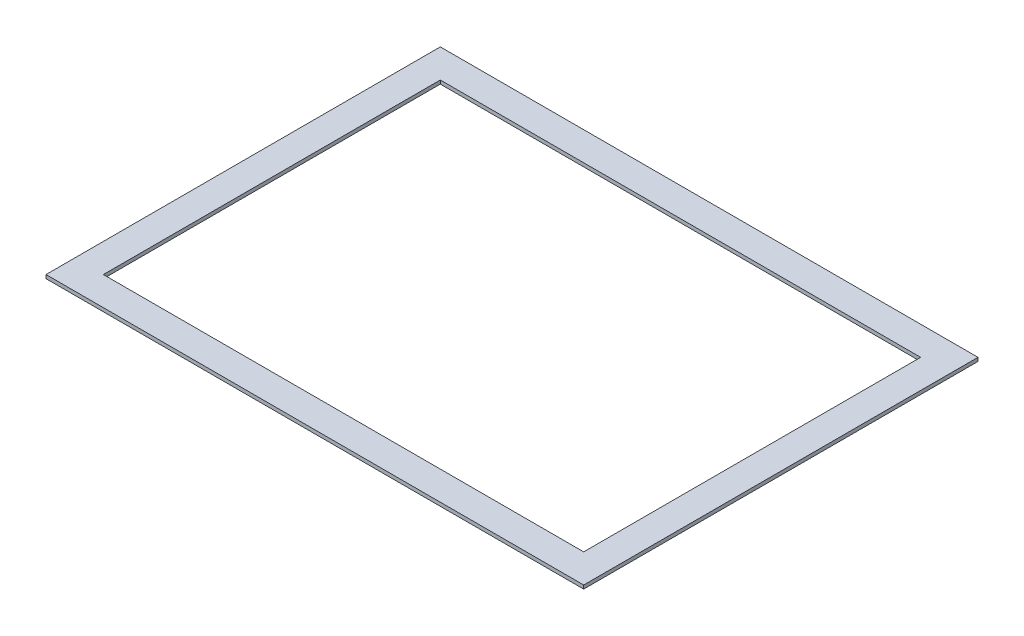
ISO-10303-21;
HEADER;
FILE_DESCRIPTION(('STEP AP214'),'2;1');
FILE_NAME('part.step','',(''),(''),'','','');
FILE_SCHEMA(('AUTOMOTIVE_DESIGN { 1 0 10303 214 1 1 1 1 }'));
ENDSEC;
DATA;
#1=APPLICATION_CONTEXT('core data for automotive mechanical design processes');
#2=APPLICATION_PROTOCOL_DEFINITION('international standard','automotive_design',2000,#1);
#3=PRODUCT_CONTEXT('',#1,'mechanical');
#4=PRODUCT('Part','Part','',(#3));
#5=PRODUCT_RELATED_PRODUCT_CATEGORY('part','',(#4));
#6=PRODUCT_DEFINITION_FORMATION('','',#4);
#7=PRODUCT_DEFINITION_CONTEXT('part definition',#1,'design');
#8=PRODUCT_DEFINITION('design','',#6,#7);
#9=PRODUCT_DEFINITION_SHAPE('','',#8);
#10=(LENGTH_UNIT() NAMED_UNIT(*) SI_UNIT(.MILLI.,.METRE.));
#11=(NAMED_UNIT(*) PLANE_ANGLE_UNIT() SI_UNIT($,.RADIAN.));
#12=(NAMED_UNIT(*) SI_UNIT($,.STERADIAN.) SOLID_ANGLE_UNIT());
#13=UNCERTAINTY_MEASURE_WITH_UNIT(LENGTH_MEASURE(1.E-05),#10,'distance_accuracy_value','');
#14=(GEOMETRIC_REPRESENTATION_CONTEXT(3) GLOBAL_UNCERTAINTY_ASSIGNED_CONTEXT((#13)) GLOBAL_UNIT_ASSIGNED_CONTEXT((#10,
#11,#12)) REPRESENTATION_CONTEXT('',''));
#15=CARTESIAN_POINT('',(0.,0.,0.));
#16=DIRECTION('',(0.,0.,1.));
#17=DIRECTION('',(1.,0.,0.));
#18=AXIS2_PLACEMENT_3D('',#15,#16,#17);
#19=CARTESIAN_POINT('',(0.,3.175,0.));
#20=DIRECTION('',(0.,-1.,0.));
#21=DIRECTION('',(0.,0.,-1.));
#22=AXIS2_PLACEMENT_3D('',#19,#20,#21);
#23=PLANE('',#22);
#24=DIRECTION('',(0.,0.,-1.));
#25=VECTOR('',#24,1.);
#26=CARTESIAN_POINT('',(238.125,3.175,174.625));
#27=LINE('',#26,#25);
#28=CARTESIAN_POINT('',(238.125,3.175,174.625));
#29=VERTEX_POINT('',#28);
#30=CARTESIAN_POINT('',(238.125,3.175,-174.625));
#31=VERTEX_POINT('',#30);
#32=EDGE_CURVE('E159',#29,#31,#27,.T.);
#33=ORIENTED_EDGE('',*,*,#32,.T.);
#34=DIRECTION('',(-1.,0.,0.));
#35=VECTOR('',#34,1.);
#36=CARTESIAN_POINT('',(-238.125,3.175,-174.625));
#37=LINE('',#36,#35);
#38=CARTESIAN_POINT('',(-238.125,3.175,-174.625));
#39=VERTEX_POINT('',#38);
#40=EDGE_CURVE('E163',#31,#39,#37,.T.);
#41=ORIENTED_EDGE('',*,*,#40,.T.);
#42=DIRECTION('',(0.,0.,1.));
#43=VECTOR('',#42,1.);
#44=CARTESIAN_POINT('',(-238.125,3.175,174.625));
#45=LINE('',#44,#43);
#46=CARTESIAN_POINT('',(-238.125,3.175,174.625));
#47=VERTEX_POINT('',#46);
#48=EDGE_CURVE('E167',#39,#47,#45,.T.);
#49=ORIENTED_EDGE('',*,*,#48,.T.);
#50=DIRECTION('',(1.,0.,0.));
#51=VECTOR('',#50,1.);
#52=CARTESIAN_POINT('',(-238.125,3.175,174.625));
#53=LINE('',#52,#51);
#54=EDGE_CURVE('E170',#47,#29,#53,.T.);
#55=ORIENTED_EDGE('',*,*,#54,.T.);
#56=EDGE_LOOP('',(#33,#41,#49,#55));
#57=FACE_BOUND('',#56,.T.);
#58=DIRECTION('',(0.,0.,1.));
#59=VECTOR('',#58,1.);
#60=CARTESIAN_POINT('',(-212.725,3.175,149.225));
#61=LINE('',#60,#59);
#62=CARTESIAN_POINT('',(-212.725,3.175,-149.225));
#63=VERTEX_POINT('',#62);
#64=CARTESIAN_POINT('',(-212.725,3.175,149.225));
#65=VERTEX_POINT('',#64);
#66=EDGE_CURVE('E111',#63,#65,#61,.T.);
#67=ORIENTED_EDGE('',*,*,#66,.F.);
#68=DIRECTION('',(-1.,0.,0.));
#69=VECTOR('',#68,1.);
#70=CARTESIAN_POINT('',(-212.725,3.175,-149.225));
#71=LINE('',#70,#69);
#72=CARTESIAN_POINT('',(212.725,3.175,-149.225));
#73=VERTEX_POINT('',#72);
#74=EDGE_CURVE('E137',#73,#63,#71,.T.);
#75=ORIENTED_EDGE('',*,*,#74,.F.);
#76=DIRECTION('',(0.,0.,-1.));
#77=VECTOR('',#76,1.);
#78=CARTESIAN_POINT('',(212.725,3.175,149.225));
#79=LINE('',#78,#77);
#80=CARTESIAN_POINT('',(212.725,3.175,149.225));
#81=VERTEX_POINT('',#80);
#82=EDGE_CURVE('E133',#81,#73,#79,.T.);
#83=ORIENTED_EDGE('',*,*,#82,.F.);
#84=DIRECTION('',(1.,0.,0.));
#85=VECTOR('',#84,1.);
#86=CARTESIAN_POINT('',(-212.725,3.175,149.225));
#87=LINE('',#86,#85);
#88=EDGE_CURVE('E120',#65,#81,#87,.T.);
#89=ORIENTED_EDGE('',*,*,#88,.F.);
#90=EDGE_LOOP('',(#67,#75,#83,#89));
#91=FACE_BOUND('',#90,.T.);
#92=ADVANCED_FACE('F45',(#57,#91),#23,.F.);
#93=CARTESIAN_POINT('',(0.,0.,0.));
#94=DIRECTION('',(0.,-1.,0.));
#95=DIRECTION('',(0.,0.,-1.));
#96=AXIS2_PLACEMENT_3D('',#93,#94,#95);
#97=PLANE('',#96);
#98=DIRECTION('',(0.,0.,-1.));
#99=VECTOR('',#98,1.);
#100=CARTESIAN_POINT('',(238.125,0.,174.625));
#101=LINE('',#100,#99);
#102=CARTESIAN_POINT('',(238.125,0.,174.625));
#103=VERTEX_POINT('',#102);
#104=CARTESIAN_POINT('',(238.125,0.,-174.625));
#105=VERTEX_POINT('',#104);
#106=EDGE_CURVE('E129',#103,#105,#101,.T.);
#107=ORIENTED_EDGE('',*,*,#106,.F.);
#108=DIRECTION('',(1.,0.,0.));
#109=VECTOR('',#108,1.);
#110=CARTESIAN_POINT('',(-238.125,0.,174.625));
#111=LINE('',#110,#109);
#112=CARTESIAN_POINT('',(-238.125,0.,174.625));
#113=VERTEX_POINT('',#112);
#114=EDGE_CURVE('E164',#113,#103,#111,.T.);
#115=ORIENTED_EDGE('',*,*,#114,.F.);
#116=DIRECTION('',(0.,0.,1.));
#117=VECTOR('',#116,1.);
#118=CARTESIAN_POINT('',(-238.125,0.,174.625));
#119=LINE('',#118,#117);
#120=CARTESIAN_POINT('',(-238.125,0.,-174.625));
#121=VERTEX_POINT('',#120);
#122=EDGE_CURVE('E180',#121,#113,#119,.T.);
#123=ORIENTED_EDGE('',*,*,#122,.F.);
#124=DIRECTION('',(-1.,0.,0.));
#125=VECTOR('',#124,1.);
#126=CARTESIAN_POINT('',(-238.125,0.,-174.625));
#127=LINE('',#126,#125);
#128=EDGE_CURVE('E177',#105,#121,#127,.T.);
#129=ORIENTED_EDGE('',*,*,#128,.F.);
#130=EDGE_LOOP('',(#107,#115,#123,#129));
#131=FACE_BOUND('',#130,.T.);
#132=DIRECTION('',(-1.,0.,0.));
#133=VECTOR('',#132,1.);
#134=CARTESIAN_POINT('',(-212.725,0.,-149.225));
#135=LINE('',#134,#133);
#136=CARTESIAN_POINT('',(212.725,0.,-149.225));
#137=VERTEX_POINT('',#136);
#138=CARTESIAN_POINT('',(-212.725,0.,-149.225));
#139=VERTEX_POINT('',#138);
#140=EDGE_CURVE('E121',#137,#139,#135,.T.);
#141=ORIENTED_EDGE('',*,*,#140,.T.);
#142=DIRECTION('',(0.,0.,1.));
#143=VECTOR('',#142,1.);
#144=CARTESIAN_POINT('',(-212.725,0.,149.225));
#145=LINE('',#144,#143);
#146=CARTESIAN_POINT('',(-212.725,0.,149.225));
#147=VERTEX_POINT('',#146);
#148=EDGE_CURVE('E69',#139,#147,#145,.T.);
#149=ORIENTED_EDGE('',*,*,#148,.T.);
#150=DIRECTION('',(1.,0.,0.));
#151=VECTOR('',#150,1.);
#152=CARTESIAN_POINT('',(-212.725,0.,149.225));
#153=LINE('',#152,#151);
#154=CARTESIAN_POINT('',(212.725,0.,149.225));
#155=VERTEX_POINT('',#154);
#156=EDGE_CURVE('E127',#147,#155,#153,.T.);
#157=ORIENTED_EDGE('',*,*,#156,.T.);
#158=DIRECTION('',(0.,0.,-1.));
#159=VECTOR('',#158,1.);
#160=CARTESIAN_POINT('',(212.725,0.,149.225));
#161=LINE('',#160,#159);
#162=EDGE_CURVE('E146',#155,#137,#161,.T.);
#163=ORIENTED_EDGE('',*,*,#162,.T.);
#164=EDGE_LOOP('',(#141,#149,#157,#163));
#165=FACE_BOUND('',#164,.T.);
#166=ADVANCED_FACE('F203',(#131,#165),#97,.T.);
#167=CARTESIAN_POINT('',(238.125,3.175,174.625));
#168=DIRECTION('',(-1.,0.,0.));
#169=DIRECTION('',(0.,0.,1.));
#170=AXIS2_PLACEMENT_3D('',#167,#168,#169);
#171=PLANE('',#170);
#172=ORIENTED_EDGE('',*,*,#106,.T.);
#173=DIRECTION('',(0.,-1.,0.));
#174=VECTOR('',#173,1.);
#175=CARTESIAN_POINT('',(238.125,3.175,-174.625));
#176=LINE('',#175,#174);
#177=EDGE_CURVE('E11',#31,#105,#176,.T.);
#178=ORIENTED_EDGE('',*,*,#177,.F.);
#179=ORIENTED_EDGE('',*,*,#32,.F.);
#180=DIRECTION('',(0.,-1.,0.));
#181=VECTOR('',#180,1.);
#182=CARTESIAN_POINT('',(238.125,3.175,174.625));
#183=LINE('',#182,#181);
#184=EDGE_CURVE('E173',#29,#103,#183,.T.);
#185=ORIENTED_EDGE('',*,*,#184,.T.);
#186=EDGE_LOOP('',(#172,#178,#179,#185));
#187=FACE_BOUND('',#186,.T.);
#188=ADVANCED_FACE('F47',(#187),#171,.F.);
#189=CARTESIAN_POINT('',(-238.125,3.175,-174.625));
#190=DIRECTION('',(0.,0.,1.));
#191=DIRECTION('',(1.,0.,0.));
#192=AXIS2_PLACEMENT_3D('',#189,#190,#191);
#193=PLANE('',#192);
#194=ORIENTED_EDGE('',*,*,#128,.T.);
#195=DIRECTION('',(0.,-1.,0.));
#196=VECTOR('',#195,1.);
#197=CARTESIAN_POINT('',(-238.125,3.175,-174.625));
#198=LINE('',#197,#196);
#199=EDGE_CURVE('E54',#39,#121,#198,.T.);
#200=ORIENTED_EDGE('',*,*,#199,.F.);
#201=ORIENTED_EDGE('',*,*,#40,.F.);
#202=ORIENTED_EDGE('',*,*,#177,.T.);
#203=EDGE_LOOP('',(#194,#200,#201,#202));
#204=FACE_BOUND('',#203,.T.);
#205=ADVANCED_FACE('F213',(#204),#193,.F.);
#206=CARTESIAN_POINT('',(-238.125,3.175,174.625));
#207=DIRECTION('',(1.,0.,0.));
#208=DIRECTION('',(0.,0.,-1.));
#209=AXIS2_PLACEMENT_3D('',#206,#207,#208);
#210=PLANE('',#209);
#211=ORIENTED_EDGE('',*,*,#122,.T.);
#212=DIRECTION('',(0.,-1.,0.));
#213=VECTOR('',#212,1.);
#214=CARTESIAN_POINT('',(-238.125,3.175,174.625));
#215=LINE('',#214,#213);
#216=EDGE_CURVE('E188',#47,#113,#215,.T.);
#217=ORIENTED_EDGE('',*,*,#216,.F.);
#218=ORIENTED_EDGE('',*,*,#48,.F.);
#219=ORIENTED_EDGE('',*,*,#199,.T.);
#220=EDGE_LOOP('',(#211,#217,#218,#219));
#221=FACE_BOUND('',#220,.T.);
#222=ADVANCED_FACE('F197',(#221),#210,.F.);
#223=CARTESIAN_POINT('',(-238.125,3.175,174.625));
#224=DIRECTION('',(0.,0.,-1.));
#225=DIRECTION('',(-1.,0.,0.));
#226=AXIS2_PLACEMENT_3D('',#223,#224,#225);
#227=PLANE('',#226);
#228=ORIENTED_EDGE('',*,*,#114,.T.);
#229=ORIENTED_EDGE('',*,*,#184,.F.);
#230=ORIENTED_EDGE('',*,*,#54,.F.);
#231=ORIENTED_EDGE('',*,*,#216,.T.);
#232=EDGE_LOOP('',(#228,#229,#230,#231));
#233=FACE_BOUND('',#232,.T.);
#234=ADVANCED_FACE('F207',(#233),#227,.F.);
#235=CARTESIAN_POINT('',(-212.725,3.175,149.225));
#236=DIRECTION('',(1.,0.,0.));
#237=DIRECTION('',(0.,0.,-1.));
#238=AXIS2_PLACEMENT_3D('',#235,#236,#237);
#239=PLANE('',#238);
#240=ORIENTED_EDGE('',*,*,#148,.F.);
#241=DIRECTION('',(0.,-1.,0.));
#242=VECTOR('',#241,1.);
#243=CARTESIAN_POINT('',(-212.725,3.175,-149.225));
#244=LINE('',#243,#242);
#245=EDGE_CURVE('E115',#63,#139,#244,.T.);
#246=ORIENTED_EDGE('',*,*,#245,.F.);
#247=ORIENTED_EDGE('',*,*,#66,.T.);
#248=DIRECTION('',(0.,-1.,0.));
#249=VECTOR('',#248,1.);
#250=CARTESIAN_POINT('',(-212.725,3.175,149.225));
#251=LINE('',#250,#249);
#252=EDGE_CURVE('E114',#65,#147,#251,.T.);
#253=ORIENTED_EDGE('',*,*,#252,.T.);
#254=EDGE_LOOP('',(#240,#246,#247,#253));
#255=FACE_BOUND('',#254,.T.);
#256=ADVANCED_FACE('F113',(#255),#239,.T.);
#257=CARTESIAN_POINT('',(-212.725,3.175,149.225));
#258=DIRECTION('',(0.,0.,-1.));
#259=DIRECTION('',(-1.,0.,0.));
#260=AXIS2_PLACEMENT_3D('',#257,#258,#259);
#261=PLANE('',#260);
#262=ORIENTED_EDGE('',*,*,#156,.F.);
#263=ORIENTED_EDGE('',*,*,#252,.F.);
#264=ORIENTED_EDGE('',*,*,#88,.T.);
#265=DIRECTION('',(0.,-1.,0.));
#266=VECTOR('',#265,1.);
#267=CARTESIAN_POINT('',(212.725,3.175,149.225));
#268=LINE('',#267,#266);
#269=EDGE_CURVE('E130',#81,#155,#268,.T.);
#270=ORIENTED_EDGE('',*,*,#269,.T.);
#271=EDGE_LOOP('',(#262,#263,#264,#270));
#272=FACE_BOUND('',#271,.T.);
#273=ADVANCED_FACE('F124',(#272),#261,.T.);
#274=CARTESIAN_POINT('',(212.725,3.175,149.225));
#275=DIRECTION('',(-1.,0.,0.));
#276=DIRECTION('',(0.,0.,1.));
#277=AXIS2_PLACEMENT_3D('',#274,#275,#276);
#278=PLANE('',#277);
#279=ORIENTED_EDGE('',*,*,#162,.F.);
#280=ORIENTED_EDGE('',*,*,#269,.F.);
#281=ORIENTED_EDGE('',*,*,#82,.T.);
#282=DIRECTION('',(0.,-1.,0.));
#283=VECTOR('',#282,1.);
#284=CARTESIAN_POINT('',(212.725,3.175,-149.225));
#285=LINE('',#284,#283);
#286=EDGE_CURVE('E61',#73,#137,#285,.T.);
#287=ORIENTED_EDGE('',*,*,#286,.T.);
#288=EDGE_LOOP('',(#279,#280,#281,#287));
#289=FACE_BOUND('',#288,.T.);
#290=ADVANCED_FACE('F236',(#289),#278,.T.);
#291=CARTESIAN_POINT('',(-212.725,3.175,-149.225));
#292=DIRECTION('',(0.,0.,1.));
#293=DIRECTION('',(1.,0.,0.));
#294=AXIS2_PLACEMENT_3D('',#291,#292,#293);
#295=PLANE('',#294);
#296=ORIENTED_EDGE('',*,*,#140,.F.);
#297=ORIENTED_EDGE('',*,*,#286,.F.);
#298=ORIENTED_EDGE('',*,*,#74,.T.);
#299=ORIENTED_EDGE('',*,*,#245,.T.);
#300=EDGE_LOOP('',(#296,#297,#298,#299));
#301=FACE_BOUND('',#300,.T.);
#302=ADVANCED_FACE('F240',(#301),#295,.T.);
#303=CLOSED_SHELL('',(#92,#166,#188,#205,#222,#234,#256,#273,#290,#302));
#304=MANIFOLD_SOLID_BREP('B2',#303);
#305=ADVANCED_BREP_SHAPE_REPRESENTATION('',(#18,#304),#14);
#306=SHAPE_DEFINITION_REPRESENTATION(#9,#305);
ENDSEC;
END-ISO-10303-21;
